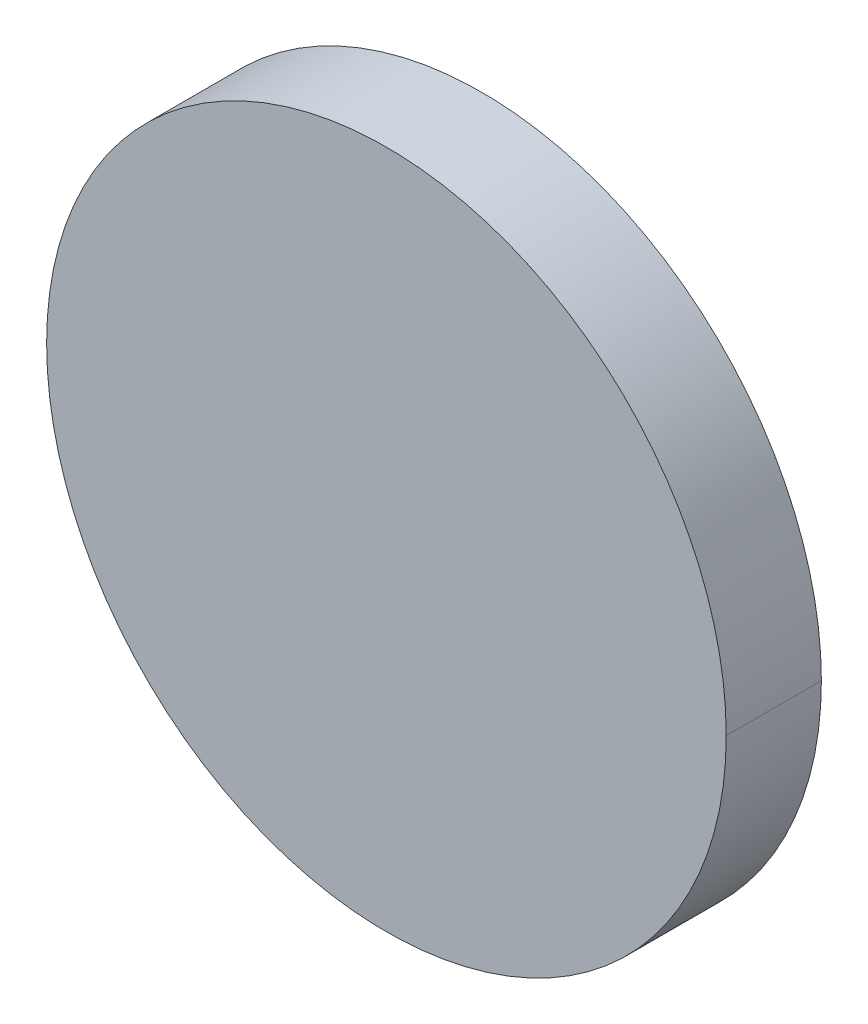
ISO-10303-21;
HEADER;
FILE_DESCRIPTION(('STEP AP214'),'2;1');
FILE_NAME('part.step','',(''),(''),'','','');
FILE_SCHEMA(('AUTOMOTIVE_DESIGN { 1 0 10303 214 1 1 1 1 }'));
ENDSEC;
DATA;
#1=APPLICATION_CONTEXT('core data for automotive mechanical design processes');
#2=APPLICATION_PROTOCOL_DEFINITION('international standard','automotive_design',2000,#1);
#3=PRODUCT_CONTEXT('',#1,'mechanical');
#4=PRODUCT('Part','Part','',(#3));
#5=PRODUCT_RELATED_PRODUCT_CATEGORY('part','',(#4));
#6=PRODUCT_DEFINITION_FORMATION('','',#4);
#7=PRODUCT_DEFINITION_CONTEXT('part definition',#1,'design');
#8=PRODUCT_DEFINITION('design','',#6,#7);
#9=PRODUCT_DEFINITION_SHAPE('','',#8);
#10=(LENGTH_UNIT() NAMED_UNIT(*) SI_UNIT(.MILLI.,.METRE.));
#11=(NAMED_UNIT(*) PLANE_ANGLE_UNIT() SI_UNIT($,.RADIAN.));
#12=(NAMED_UNIT(*) SI_UNIT($,.STERADIAN.) SOLID_ANGLE_UNIT());
#13=UNCERTAINTY_MEASURE_WITH_UNIT(LENGTH_MEASURE(1.E-05),#10,'distance_accuracy_value','');
#14=(GEOMETRIC_REPRESENTATION_CONTEXT(3) GLOBAL_UNCERTAINTY_ASSIGNED_CONTEXT((#13)) GLOBAL_UNIT_ASSIGNED_CONTEXT((#10,
#11,#12)) REPRESENTATION_CONTEXT('',''));
#15=CARTESIAN_POINT('',(0.,0.,0.));
#16=DIRECTION('',(0.,0.,1.));
#17=DIRECTION('',(1.,0.,0.));
#18=AXIS2_PLACEMENT_3D('',#15,#16,#17);
#19=CARTESIAN_POINT('',(97.4440012,84.1869284,0.));
#20=DIRECTION('',(-1.,0.,0.));
#21=DIRECTION('',(0.,1.,0.));
#22=AXIS2_PLACEMENT_3D('',#19,#20,#21);
#23=PLANE('',#22);
#24=DIRECTION('',(0.,1.,0.));
#25=VECTOR('',#24,1.);
#26=CARTESIAN_POINT('',(97.4440012,84.1869284,0.03556));
#27=LINE('',#26,#25);
#28=CARTESIAN_POINT('',(97.4440012,84.1869284,0.03556));
#29=VERTEX_POINT('',#28);
#30=CARTESIAN_POINT('',(97.4440012,84.18694364,0.03556));
#31=VERTEX_POINT('',#30);
#32=EDGE_CURVE('E11',#29,#31,#27,.T.);
#33=ORIENTED_EDGE('',*,*,#32,.F.);
#34=DIRECTION('',(0.,0.,1.));
#35=VECTOR('',#34,1.);
#36=CARTESIAN_POINT('',(97.4440012,84.1869284,0.));
#37=LINE('',#36,#35);
#38=CARTESIAN_POINT('',(97.4440012,84.1869284,0.));
#39=VERTEX_POINT('',#38);
#40=EDGE_CURVE('E24',#39,#29,#37,.T.);
#41=ORIENTED_EDGE('',*,*,#40,.F.);
#42=DIRECTION('',(0.,1.,0.));
#43=VECTOR('',#42,1.);
#44=CARTESIAN_POINT('',(97.4440012,84.1869284,0.));
#45=LINE('',#44,#43);
#46=CARTESIAN_POINT('',(97.4440012,84.18694364,0.));
#47=VERTEX_POINT('',#46);
#48=EDGE_CURVE('E75',#39,#47,#45,.T.);
#49=ORIENTED_EDGE('',*,*,#48,.T.);
#50=DIRECTION('',(0.,0.,1.));
#51=VECTOR('',#50,1.);
#52=CARTESIAN_POINT('',(97.4440012,84.18694364,0.));
#53=LINE('',#52,#51);
#54=EDGE_CURVE('E37',#47,#31,#53,.T.);
#55=ORIENTED_EDGE('',*,*,#54,.T.);
#56=EDGE_LOOP('',(#33,#41,#49,#55));
#57=FACE_BOUND('',#56,.T.);
#58=ADVANCED_FACE('F17',(#57),#23,.F.);
#59=CARTESIAN_POINT('',(97.3170012,84.18694364,0.));
#60=DIRECTION('',(0.,0.,-1.));
#61=DIRECTION('',(1.,0.,0.));
#62=AXIS2_PLACEMENT_3D('',#59,#60,#61);
#63=CYLINDRICAL_SURFACE('',#62,0.127000000000005);
#64=CARTESIAN_POINT('',(97.3170012,84.18694364,0.03556));
#65=DIRECTION('',(0.,0.,1.));
#66=DIRECTION('',(1.,0.,0.));
#67=AXIS2_PLACEMENT_3D('',#64,#65,#66);
#68=CIRCLE('',#67,0.127000000000005);
#69=CARTESIAN_POINT('',(97.1900012,84.18694364,0.03556));
#70=VERTEX_POINT('',#69);
#71=EDGE_CURVE('E83',#31,#70,#68,.T.);
#72=ORIENTED_EDGE('',*,*,#71,.F.);
#73=ORIENTED_EDGE('',*,*,#54,.F.);
#74=CARTESIAN_POINT('',(97.3170012,84.18694364,0.));
#75=DIRECTION('',(0.,0.,1.));
#76=DIRECTION('',(1.,0.,0.));
#77=AXIS2_PLACEMENT_3D('',#74,#75,#76);
#78=CIRCLE('',#77,0.127000000000005);
#79=CARTESIAN_POINT('',(97.1900012,84.18694364,0.));
#80=VERTEX_POINT('',#79);
#81=EDGE_CURVE('E81',#47,#80,#78,.T.);
#82=ORIENTED_EDGE('',*,*,#81,.T.);
#83=DIRECTION('',(0.,0.,1.));
#84=VECTOR('',#83,1.);
#85=CARTESIAN_POINT('',(97.1900012,84.18694364,0.));
#86=LINE('',#85,#84);
#87=EDGE_CURVE('E67',#80,#70,#86,.T.);
#88=ORIENTED_EDGE('',*,*,#87,.T.);
#89=EDGE_LOOP('',(#72,#73,#82,#88));
#90=FACE_BOUND('',#89,.T.);
#91=ADVANCED_FACE('F89',(#90),#63,.T.);
#92=CARTESIAN_POINT('',(97.1900012,84.18694364,0.));
#93=DIRECTION('',(1.,0.,0.));
#94=DIRECTION('',(0.,-1.,0.));
#95=AXIS2_PLACEMENT_3D('',#92,#93,#94);
#96=PLANE('',#95);
#97=DIRECTION('',(0.,-1.,0.));
#98=VECTOR('',#97,1.);
#99=CARTESIAN_POINT('',(97.1900012,84.18694364,0.03556));
#100=LINE('',#99,#98);
#101=CARTESIAN_POINT('',(97.1900012,84.1869284,0.03556));
#102=VERTEX_POINT('',#101);
#103=EDGE_CURVE('E71',#70,#102,#100,.T.);
#104=ORIENTED_EDGE('',*,*,#103,.F.);
#105=ORIENTED_EDGE('',*,*,#87,.F.);
#106=DIRECTION('',(0.,-1.,0.));
#107=VECTOR('',#106,1.);
#108=CARTESIAN_POINT('',(97.1900012,84.18694364,0.));
#109=LINE('',#108,#107);
#110=CARTESIAN_POINT('',(97.1900012,84.1869284,0.));
#111=VERTEX_POINT('',#110);
#112=EDGE_CURVE('E63',#80,#111,#109,.T.);
#113=ORIENTED_EDGE('',*,*,#112,.T.);
#114=DIRECTION('',(0.,0.,1.));
#115=VECTOR('',#114,1.);
#116=CARTESIAN_POINT('',(97.1900012,84.1869284,0.));
#117=LINE('',#116,#115);
#118=EDGE_CURVE('E53',#111,#102,#117,.T.);
#119=ORIENTED_EDGE('',*,*,#118,.T.);
#120=EDGE_LOOP('',(#104,#105,#113,#119));
#121=FACE_BOUND('',#120,.T.);
#122=ADVANCED_FACE('F66',(#121),#96,.F.);
#123=CARTESIAN_POINT('',(97.3170012,84.1869284,0.));
#124=DIRECTION('',(0.,0.,-1.));
#125=DIRECTION('',(-1.,0.,0.));
#126=AXIS2_PLACEMENT_3D('',#123,#124,#125);
#127=CYLINDRICAL_SURFACE('',#126,0.127);
#128=CARTESIAN_POINT('',(97.3170012,84.1869284,0.03556));
#129=DIRECTION('',(0.,0.,1.));
#130=DIRECTION('',(-1.,0.,0.));
#131=AXIS2_PLACEMENT_3D('',#128,#129,#130);
#132=CIRCLE('',#131,0.127);
#133=EDGE_CURVE('E59',#102,#29,#132,.T.);
#134=ORIENTED_EDGE('',*,*,#133,.F.);
#135=ORIENTED_EDGE('',*,*,#118,.F.);
#136=CARTESIAN_POINT('',(97.3170012,84.1869284,0.));
#137=DIRECTION('',(0.,0.,1.));
#138=DIRECTION('',(-1.,0.,0.));
#139=AXIS2_PLACEMENT_3D('',#136,#137,#138);
#140=CIRCLE('',#139,0.127);
#141=EDGE_CURVE('E57',#111,#39,#140,.T.);
#142=ORIENTED_EDGE('',*,*,#141,.T.);
#143=ORIENTED_EDGE('',*,*,#40,.T.);
#144=EDGE_LOOP('',(#134,#135,#142,#143));
#145=FACE_BOUND('',#144,.T.);
#146=ADVANCED_FACE('F55',(#145),#127,.T.);
#147=CARTESIAN_POINT('',(97.4440012,84.1869284,0.));
#148=DIRECTION('',(0.,0.,-1.));
#149=DIRECTION('',(-1.,0.,0.));
#150=AXIS2_PLACEMENT_3D('',#147,#148,#149);
#151=PLANE('',#150);
#152=ORIENTED_EDGE('',*,*,#141,.F.);
#153=ORIENTED_EDGE('',*,*,#112,.F.);
#154=ORIENTED_EDGE('',*,*,#81,.F.);
#155=ORIENTED_EDGE('',*,*,#48,.F.);
#156=EDGE_LOOP('',(#152,#153,#154,#155));
#157=FACE_BOUND('',#156,.T.);
#158=ADVANCED_FACE('F74',(#157),#151,.T.);
#159=CARTESIAN_POINT('',(97.4440012,84.1869284,0.03556));
#160=DIRECTION('',(0.,0.,-1.));
#161=DIRECTION('',(-1.,0.,0.));
#162=AXIS2_PLACEMENT_3D('',#159,#160,#161);
#163=PLANE('',#162);
#164=ORIENTED_EDGE('',*,*,#32,.T.);
#165=ORIENTED_EDGE('',*,*,#71,.T.);
#166=ORIENTED_EDGE('',*,*,#103,.T.);
#167=ORIENTED_EDGE('',*,*,#133,.T.);
#168=EDGE_LOOP('',(#164,#165,#166,#167));
#169=FACE_BOUND('',#168,.T.);
#170=ADVANCED_FACE('F91',(#169),#163,.F.);
#171=CLOSED_SHELL('',(#58,#91,#122,#146,#158,#170));
#172=MANIFOLD_SOLID_BREP('B1',#171);
#173=ADVANCED_BREP_SHAPE_REPRESENTATION('',(#18,#172),#14);
#174=SHAPE_DEFINITION_REPRESENTATION(#9,#173);
ENDSEC;
END-ISO-10303-21;
